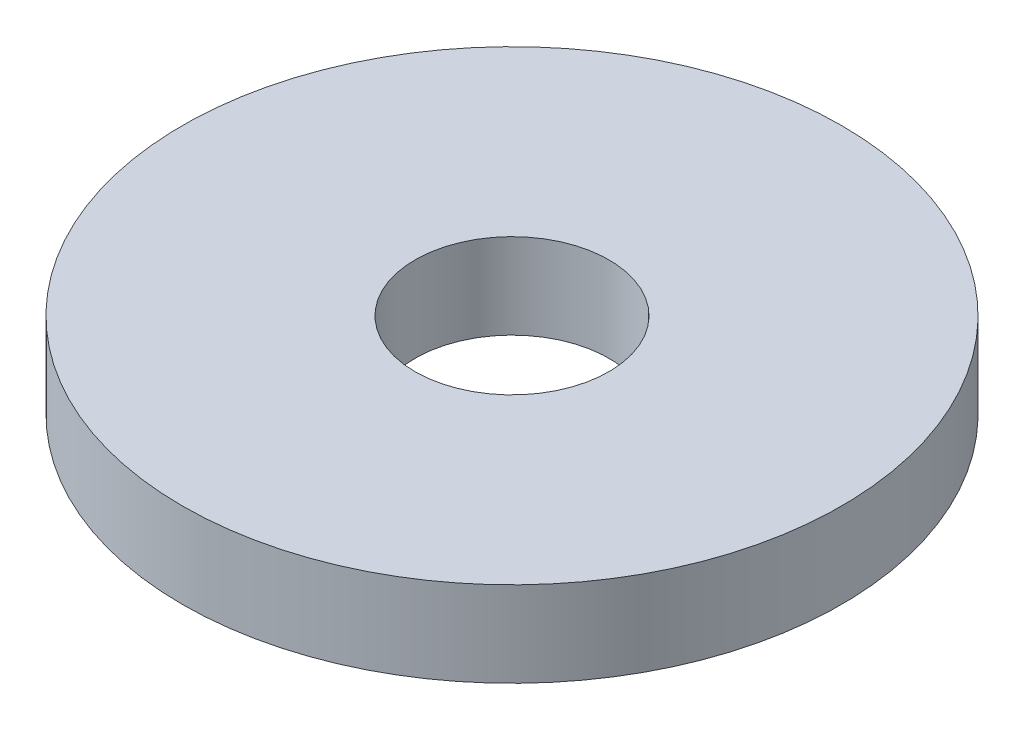
ISO-10303-21;
HEADER;
FILE_DESCRIPTION(('STEP AP214'),'2;1');
FILE_NAME('part.step','',(''),(''),'','','');
FILE_SCHEMA(('AUTOMOTIVE_DESIGN { 1 0 10303 214 1 1 1 1 }'));
ENDSEC;
DATA;
#1=APPLICATION_CONTEXT('core data for automotive mechanical design processes');
#2=APPLICATION_PROTOCOL_DEFINITION('international standard','automotive_design',2000,#1);
#3=PRODUCT_CONTEXT('',#1,'mechanical');
#4=PRODUCT('Part','Part','',(#3));
#5=PRODUCT_RELATED_PRODUCT_CATEGORY('part','',(#4));
#6=PRODUCT_DEFINITION_FORMATION('','',#4);
#7=PRODUCT_DEFINITION_CONTEXT('part definition',#1,'design');
#8=PRODUCT_DEFINITION('design','',#6,#7);
#9=PRODUCT_DEFINITION_SHAPE('','',#8);
#10=(LENGTH_UNIT() NAMED_UNIT(*) SI_UNIT(.MILLI.,.METRE.));
#11=(NAMED_UNIT(*) PLANE_ANGLE_UNIT() SI_UNIT($,.RADIAN.));
#12=(NAMED_UNIT(*) SI_UNIT($,.STERADIAN.) SOLID_ANGLE_UNIT());
#13=UNCERTAINTY_MEASURE_WITH_UNIT(LENGTH_MEASURE(1.E-05),#10,'distance_accuracy_value','');
#14=(GEOMETRIC_REPRESENTATION_CONTEXT(3) GLOBAL_UNCERTAINTY_ASSIGNED_CONTEXT((#13)) GLOBAL_UNIT_ASSIGNED_CONTEXT((#10,
#11,#12)) REPRESENTATION_CONTEXT('',''));
#15=CARTESIAN_POINT('',(0.,0.,0.));
#16=DIRECTION('',(0.,0.,1.));
#17=DIRECTION('',(1.,0.,0.));
#18=AXIS2_PLACEMENT_3D('',#15,#16,#17);
#19=CARTESIAN_POINT('',(0.,22.,0.));
#20=DIRECTION('',(0.,-1.,0.));
#21=DIRECTION('',(0.,0.,-1.));
#22=AXIS2_PLACEMENT_3D('',#19,#20,#21);
#23=CYLINDRICAL_SURFACE('',#22,85.);
#24=CARTESIAN_POINT('',(0.,22.,0.));
#25=DIRECTION('',(0.,1.,0.));
#26=DIRECTION('',(0.,0.,1.));
#27=AXIS2_PLACEMENT_3D('',#24,#25,#26);
#28=CIRCLE('',#27,85.);
#29=CARTESIAN_POINT('',(0.,22.,85.));
#30=VERTEX_POINT('',#29);
#31=EDGE_CURVE('E10',#30,#30,#28,.T.);
#32=ORIENTED_EDGE('',*,*,#31,.F.);
#33=EDGE_LOOP('',(#32));
#34=FACE_BOUND('',#33,.T.);
#35=CARTESIAN_POINT('',(0.,0.,0.));
#36=DIRECTION('',(0.,1.,0.));
#37=DIRECTION('',(0.,0.,1.));
#38=AXIS2_PLACEMENT_3D('',#35,#36,#37);
#39=CIRCLE('',#38,85.);
#40=CARTESIAN_POINT('',(0.,0.,85.));
#41=VERTEX_POINT('',#40);
#42=EDGE_CURVE('E37',#41,#41,#39,.T.);
#43=ORIENTED_EDGE('',*,*,#42,.T.);
#44=EDGE_LOOP('',(#43));
#45=FACE_BOUND('',#44,.T.);
#46=ADVANCED_FACE('F40',(#34,#45),#23,.T.);
#47=CARTESIAN_POINT('',(0.,22.,0.));
#48=DIRECTION('',(0.,1.,0.));
#49=DIRECTION('',(0.,0.,1.));
#50=AXIS2_PLACEMENT_3D('',#47,#48,#49);
#51=PLANE('',#50);
#52=CARTESIAN_POINT('',(0.,22.,0.));
#53=DIRECTION('',(0.,1.,0.));
#54=DIRECTION('',(0.,0.,1.));
#55=AXIS2_PLACEMENT_3D('',#52,#53,#54);
#56=CIRCLE('',#55,25.);
#57=CARTESIAN_POINT('',(0.,22.,25.));
#58=VERTEX_POINT('',#57);
#59=EDGE_CURVE('E50',#58,#58,#56,.T.);
#60=ORIENTED_EDGE('',*,*,#59,.F.);
#61=EDGE_LOOP('',(#60));
#62=FACE_BOUND('',#61,.T.);
#63=ORIENTED_EDGE('',*,*,#31,.T.);
#64=EDGE_LOOP('',(#63));
#65=FACE_BOUND('',#64,.T.);
#66=ADVANCED_FACE('F59',(#62,#65),#51,.T.);
#67=CARTESIAN_POINT('',(0.,0.,0.));
#68=DIRECTION('',(0.,1.,0.));
#69=DIRECTION('',(0.,0.,1.));
#70=AXIS2_PLACEMENT_3D('',#67,#68,#69);
#71=PLANE('',#70);
#72=CARTESIAN_POINT('',(0.,0.,0.));
#73=DIRECTION('',(0.,1.,0.));
#74=DIRECTION('',(0.,0.,1.));
#75=AXIS2_PLACEMENT_3D('',#72,#73,#74);
#76=CIRCLE('',#75,25.);
#77=CARTESIAN_POINT('',(0.,0.,25.));
#78=VERTEX_POINT('',#77);
#79=EDGE_CURVE('E47',#78,#78,#76,.T.);
#80=ORIENTED_EDGE('',*,*,#79,.T.);
#81=EDGE_LOOP('',(#80));
#82=FACE_BOUND('',#81,.T.);
#83=ORIENTED_EDGE('',*,*,#42,.F.);
#84=EDGE_LOOP('',(#83));
#85=FACE_BOUND('',#84,.T.);
#86=ADVANCED_FACE('F58',(#82,#85),#71,.F.);
#87=CARTESIAN_POINT('',(0.,22.,0.));
#88=DIRECTION('',(0.,-1.,0.));
#89=DIRECTION('',(0.,0.,-1.));
#90=AXIS2_PLACEMENT_3D('',#87,#88,#89);
#91=CYLINDRICAL_SURFACE('',#90,25.);
#92=ORIENTED_EDGE('',*,*,#59,.T.);
#93=EDGE_LOOP('',(#92));
#94=FACE_BOUND('',#93,.T.);
#95=ORIENTED_EDGE('',*,*,#79,.F.);
#96=EDGE_LOOP('',(#95));
#97=FACE_BOUND('',#96,.T.);
#98=ADVANCED_FACE('F54',(#94,#97),#91,.F.);
#99=CLOSED_SHELL('',(#46,#66,#86,#98));
#100=MANIFOLD_SOLID_BREP('B2',#99);
#101=ADVANCED_BREP_SHAPE_REPRESENTATION('',(#18,#100),#14);
#102=SHAPE_DEFINITION_REPRESENTATION(#9,#101);
ENDSEC;
END-ISO-10303-21;
